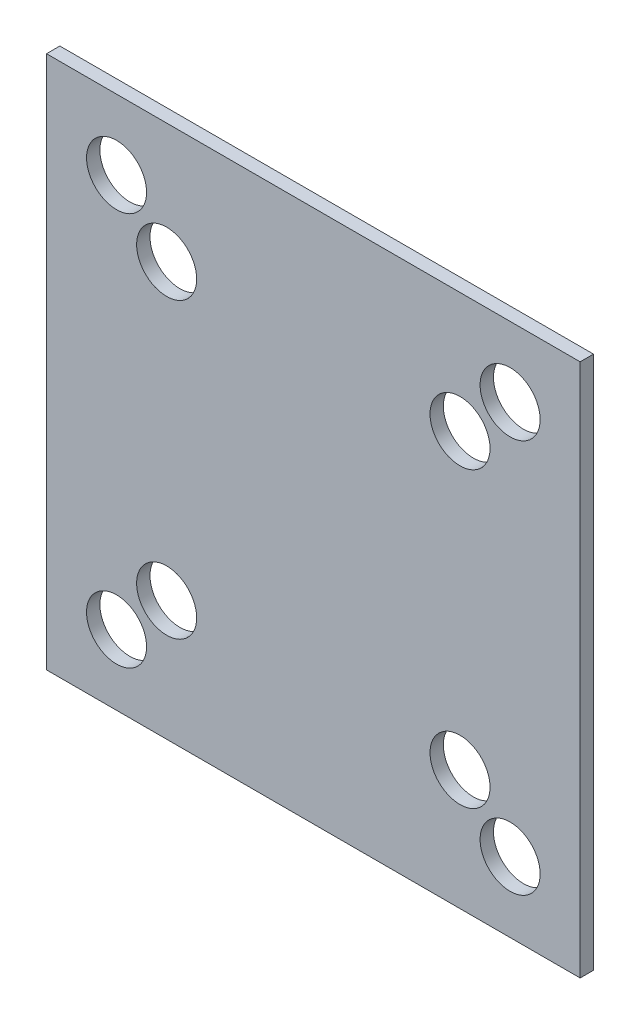
ISO-10303-21;
HEADER;
FILE_DESCRIPTION(('STEP AP214'),'2;1');
FILE_NAME('part.step','',(''),(''),'','','');
FILE_SCHEMA(('AUTOMOTIVE_DESIGN { 1 0 10303 214 1 1 1 1 }'));
ENDSEC;
DATA;
#1=APPLICATION_CONTEXT('core data for automotive mechanical design processes');
#2=APPLICATION_PROTOCOL_DEFINITION('international standard','automotive_design',2000,#1);
#3=PRODUCT_CONTEXT('',#1,'mechanical');
#4=PRODUCT('Part','Part','',(#3));
#5=PRODUCT_RELATED_PRODUCT_CATEGORY('part','',(#4));
#6=PRODUCT_DEFINITION_FORMATION('','',#4);
#7=PRODUCT_DEFINITION_CONTEXT('part definition',#1,'design');
#8=PRODUCT_DEFINITION('design','',#6,#7);
#9=PRODUCT_DEFINITION_SHAPE('','',#8);
#10=(LENGTH_UNIT() NAMED_UNIT(*) SI_UNIT(.MILLI.,.METRE.));
#11=(NAMED_UNIT(*) PLANE_ANGLE_UNIT() SI_UNIT($,.RADIAN.));
#12=(NAMED_UNIT(*) SI_UNIT($,.STERADIAN.) SOLID_ANGLE_UNIT());
#13=UNCERTAINTY_MEASURE_WITH_UNIT(LENGTH_MEASURE(1.E-05),#10,'distance_accuracy_value','');
#14=(GEOMETRIC_REPRESENTATION_CONTEXT(3) GLOBAL_UNCERTAINTY_ASSIGNED_CONTEXT((#13)) GLOBAL_UNIT_ASSIGNED_CONTEXT((#10,
#11,#12)) REPRESENTATION_CONTEXT('',''));
#15=CARTESIAN_POINT('',(0.,0.,0.));
#16=DIRECTION('',(0.,0.,1.));
#17=DIRECTION('',(1.,0.,0.));
#18=AXIS2_PLACEMENT_3D('',#15,#16,#17);
#19=CARTESIAN_POINT('',(40.,40.,2.));
#20=DIRECTION('',(-1.,0.,0.));
#21=DIRECTION('',(0.,-1.,0.));
#22=AXIS2_PLACEMENT_3D('',#19,#20,#21);
#23=PLANE('',#22);
#24=DIRECTION('',(0.,1.,0.));
#25=VECTOR('',#24,1.);
#26=CARTESIAN_POINT('',(40.,40.,0.));
#27=LINE('',#26,#25);
#28=CARTESIAN_POINT('',(40.,-40.,0.));
#29=VERTEX_POINT('',#28);
#30=CARTESIAN_POINT('',(40.,40.,0.));
#31=VERTEX_POINT('',#30);
#32=EDGE_CURVE('E123',#29,#31,#27,.T.);
#33=ORIENTED_EDGE('',*,*,#32,.T.);
#34=DIRECTION('',(0.,0.,-1.));
#35=VECTOR('',#34,1.);
#36=CARTESIAN_POINT('',(40.,40.,2.));
#37=LINE('',#36,#35);
#38=CARTESIAN_POINT('',(40.,40.,2.));
#39=VERTEX_POINT('',#38);
#40=EDGE_CURVE('E12',#39,#31,#37,.T.);
#41=ORIENTED_EDGE('',*,*,#40,.F.);
#42=DIRECTION('',(0.,1.,0.));
#43=VECTOR('',#42,1.);
#44=CARTESIAN_POINT('',(40.,40.,2.));
#45=LINE('',#44,#43);
#46=CARTESIAN_POINT('',(40.,-40.,2.));
#47=VERTEX_POINT('',#46);
#48=EDGE_CURVE('E110',#47,#39,#45,.T.);
#49=ORIENTED_EDGE('',*,*,#48,.F.);
#50=DIRECTION('',(0.,0.,-1.));
#51=VECTOR('',#50,1.);
#52=CARTESIAN_POINT('',(40.,-40.,2.));
#53=LINE('',#52,#51);
#54=EDGE_CURVE('E119',#47,#29,#53,.T.);
#55=ORIENTED_EDGE('',*,*,#54,.T.);
#56=EDGE_LOOP('',(#33,#41,#49,#55));
#57=FACE_BOUND('',#56,.T.);
#58=ADVANCED_FACE('F57',(#57),#23,.F.);
#59=CARTESIAN_POINT('',(-40.,40.,2.));
#60=DIRECTION('',(0.,-1.,0.));
#61=DIRECTION('',(0.,0.,-1.));
#62=AXIS2_PLACEMENT_3D('',#59,#60,#61);
#63=PLANE('',#62);
#64=DIRECTION('',(-1.,0.,0.));
#65=VECTOR('',#64,1.);
#66=CARTESIAN_POINT('',(-40.,40.,0.));
#67=LINE('',#66,#65);
#68=CARTESIAN_POINT('',(-40.,40.,0.));
#69=VERTEX_POINT('',#68);
#70=EDGE_CURVE('E114',#31,#69,#67,.T.);
#71=ORIENTED_EDGE('',*,*,#70,.T.);
#72=DIRECTION('',(0.,0.,-1.));
#73=VECTOR('',#72,1.);
#74=CARTESIAN_POINT('',(-40.,40.,2.));
#75=LINE('',#74,#73);
#76=CARTESIAN_POINT('',(-40.,40.,2.));
#77=VERTEX_POINT('',#76);
#78=EDGE_CURVE('E66',#77,#69,#75,.T.);
#79=ORIENTED_EDGE('',*,*,#78,.F.);
#80=DIRECTION('',(-1.,0.,0.));
#81=VECTOR('',#80,1.);
#82=CARTESIAN_POINT('',(-40.,40.,2.));
#83=LINE('',#82,#81);
#84=EDGE_CURVE('E105',#39,#77,#83,.T.);
#85=ORIENTED_EDGE('',*,*,#84,.F.);
#86=ORIENTED_EDGE('',*,*,#40,.T.);
#87=EDGE_LOOP('',(#71,#79,#85,#86));
#88=FACE_BOUND('',#87,.T.);
#89=ADVANCED_FACE('F113',(#88),#63,.F.);
#90=CARTESIAN_POINT('',(-40.,40.,2.));
#91=DIRECTION('',(1.,0.,0.));
#92=DIRECTION('',(0.,1.,0.));
#93=AXIS2_PLACEMENT_3D('',#90,#91,#92);
#94=PLANE('',#93);
#95=DIRECTION('',(0.,-1.,0.));
#96=VECTOR('',#95,1.);
#97=CARTESIAN_POINT('',(-40.,40.,0.));
#98=LINE('',#97,#96);
#99=CARTESIAN_POINT('',(-40.,-40.,0.));
#100=VERTEX_POINT('',#99);
#101=EDGE_CURVE('E92',#69,#100,#98,.T.);
#102=ORIENTED_EDGE('',*,*,#101,.T.);
#103=DIRECTION('',(0.,0.,-1.));
#104=VECTOR('',#103,1.);
#105=CARTESIAN_POINT('',(-40.,-40.,2.));
#106=LINE('',#105,#104);
#107=CARTESIAN_POINT('',(-40.,-40.,2.));
#108=VERTEX_POINT('',#107);
#109=EDGE_CURVE('E115',#108,#100,#106,.T.);
#110=ORIENTED_EDGE('',*,*,#109,.F.);
#111=DIRECTION('',(0.,-1.,0.));
#112=VECTOR('',#111,1.);
#113=CARTESIAN_POINT('',(-40.,40.,2.));
#114=LINE('',#113,#112);
#115=EDGE_CURVE('E108',#77,#108,#114,.T.);
#116=ORIENTED_EDGE('',*,*,#115,.F.);
#117=ORIENTED_EDGE('',*,*,#78,.T.);
#118=EDGE_LOOP('',(#102,#110,#116,#117));
#119=FACE_BOUND('',#118,.T.);
#120=ADVANCED_FACE('F117',(#119),#94,.F.);
#121=CARTESIAN_POINT('',(-40.,-40.,2.));
#122=DIRECTION('',(0.,1.,0.));
#123=DIRECTION('',(0.,0.,1.));
#124=AXIS2_PLACEMENT_3D('',#121,#122,#123);
#125=PLANE('',#124);
#126=DIRECTION('',(1.,0.,0.));
#127=VECTOR('',#126,1.);
#128=CARTESIAN_POINT('',(-40.,-40.,0.));
#129=LINE('',#128,#127);
#130=EDGE_CURVE('E98',#100,#29,#129,.T.);
#131=ORIENTED_EDGE('',*,*,#130,.T.);
#132=ORIENTED_EDGE('',*,*,#54,.F.);
#133=DIRECTION('',(1.,0.,0.));
#134=VECTOR('',#133,1.);
#135=CARTESIAN_POINT('',(-40.,-40.,2.));
#136=LINE('',#135,#134);
#137=EDGE_CURVE('E75',#108,#47,#136,.T.);
#138=ORIENTED_EDGE('',*,*,#137,.F.);
#139=ORIENTED_EDGE('',*,*,#109,.T.);
#140=EDGE_LOOP('',(#131,#132,#138,#139));
#141=FACE_BOUND('',#140,.T.);
#142=ADVANCED_FACE('F188',(#141),#125,.F.);
#143=CARTESIAN_POINT('',(0.,0.,2.));
#144=DIRECTION('',(0.,0.,1.));
#145=DIRECTION('',(1.,0.,0.));
#146=AXIS2_PLACEMENT_3D('',#143,#144,#145);
#147=PLANE('',#146);
#148=CARTESIAN_POINT('',(-21.99,-21.99,2.));
#149=DIRECTION('',(0.,0.,1.));
#150=DIRECTION('',(1.,0.,0.));
#151=AXIS2_PLACEMENT_3D('',#148,#149,#150);
#152=CIRCLE('',#151,4.5);
#153=CARTESIAN_POINT('',(-17.49,-21.99,2.));
#154=VERTEX_POINT('',#153);
#155=EDGE_CURVE('E306',#154,#154,#152,.T.);
#156=ORIENTED_EDGE('',*,*,#155,.F.);
#157=EDGE_LOOP('',(#156));
#158=FACE_BOUND('',#157,.T.);
#159=CARTESIAN_POINT('',(21.99,21.99,2.));
#160=DIRECTION('',(0.,0.,1.));
#161=DIRECTION('',(1.,0.,0.));
#162=AXIS2_PLACEMENT_3D('',#159,#160,#161);
#163=CIRCLE('',#162,4.5);
#164=CARTESIAN_POINT('',(26.49,21.99,2.));
#165=VERTEX_POINT('',#164);
#166=EDGE_CURVE('E301',#165,#165,#163,.T.);
#167=ORIENTED_EDGE('',*,*,#166,.F.);
#168=EDGE_LOOP('',(#167));
#169=FACE_BOUND('',#168,.T.);
#170=CARTESIAN_POINT('',(29.5,29.5,2.));
#171=DIRECTION('',(0.,0.,1.));
#172=DIRECTION('',(1.,0.,0.));
#173=AXIS2_PLACEMENT_3D('',#170,#171,#172);
#174=CIRCLE('',#173,4.5);
#175=CARTESIAN_POINT('',(34.,29.5,2.));
#176=VERTEX_POINT('',#175);
#177=EDGE_CURVE('E281',#176,#176,#174,.T.);
#178=ORIENTED_EDGE('',*,*,#177,.F.);
#179=EDGE_LOOP('',(#178));
#180=FACE_BOUND('',#179,.T.);
#181=CARTESIAN_POINT('',(21.99,-21.99,2.));
#182=DIRECTION('',(0.,0.,1.));
#183=DIRECTION('',(1.,0.,0.));
#184=AXIS2_PLACEMENT_3D('',#181,#182,#183);
#185=CIRCLE('',#184,4.5);
#186=CARTESIAN_POINT('',(26.49,-21.99,2.));
#187=VERTEX_POINT('',#186);
#188=EDGE_CURVE('E300',#187,#187,#185,.T.);
#189=ORIENTED_EDGE('',*,*,#188,.F.);
#190=EDGE_LOOP('',(#189));
#191=FACE_BOUND('',#190,.T.);
#192=CARTESIAN_POINT('',(-29.5,29.5,2.));
#193=DIRECTION('',(0.,0.,1.));
#194=DIRECTION('',(1.,0.,0.));
#195=AXIS2_PLACEMENT_3D('',#192,#193,#194);
#196=CIRCLE('',#195,4.5);
#197=CARTESIAN_POINT('',(-25.,29.5,2.));
#198=VERTEX_POINT('',#197);
#199=EDGE_CURVE('E318',#198,#198,#196,.T.);
#200=ORIENTED_EDGE('',*,*,#199,.F.);
#201=EDGE_LOOP('',(#200));
#202=FACE_BOUND('',#201,.T.);
#203=CARTESIAN_POINT('',(-21.99,21.99,2.));
#204=DIRECTION('',(0.,0.,1.));
#205=DIRECTION('',(1.,0.,0.));
#206=AXIS2_PLACEMENT_3D('',#203,#204,#205);
#207=CIRCLE('',#206,4.5);
#208=CARTESIAN_POINT('',(-17.49,21.99,2.));
#209=VERTEX_POINT('',#208);
#210=EDGE_CURVE('E315',#209,#209,#207,.T.);
#211=ORIENTED_EDGE('',*,*,#210,.F.);
#212=EDGE_LOOP('',(#211));
#213=FACE_BOUND('',#212,.T.);
#214=CARTESIAN_POINT('',(-29.5,-29.5,2.));
#215=DIRECTION('',(0.,0.,1.));
#216=DIRECTION('',(1.,0.,0.));
#217=AXIS2_PLACEMENT_3D('',#214,#215,#216);
#218=CIRCLE('',#217,4.5);
#219=CARTESIAN_POINT('',(-25.,-29.5,2.));
#220=VERTEX_POINT('',#219);
#221=EDGE_CURVE('E313',#220,#220,#218,.T.);
#222=ORIENTED_EDGE('',*,*,#221,.F.);
#223=EDGE_LOOP('',(#222));
#224=FACE_BOUND('',#223,.T.);
#225=CARTESIAN_POINT('',(29.5,-29.5,2.));
#226=DIRECTION('',(0.,0.,1.));
#227=DIRECTION('',(1.,0.,0.));
#228=AXIS2_PLACEMENT_3D('',#225,#226,#227);
#229=CIRCLE('',#228,4.5);
#230=CARTESIAN_POINT('',(34.,-29.5,2.));
#231=VERTEX_POINT('',#230);
#232=EDGE_CURVE('E135',#231,#231,#229,.T.);
#233=ORIENTED_EDGE('',*,*,#232,.F.);
#234=EDGE_LOOP('',(#233));
#235=FACE_BOUND('',#234,.T.);
#236=ORIENTED_EDGE('',*,*,#48,.T.);
#237=ORIENTED_EDGE('',*,*,#84,.T.);
#238=ORIENTED_EDGE('',*,*,#115,.T.);
#239=ORIENTED_EDGE('',*,*,#137,.T.);
#240=EDGE_LOOP('',(#236,#237,#238,#239));
#241=FACE_BOUND('',#240,.T.);
#242=ADVANCED_FACE('F106',(#158,#169,#180,#191,#202,#213,#224,#235,#241),#147,.T.);
#243=CARTESIAN_POINT('',(0.,0.,0.));
#244=DIRECTION('',(0.,0.,1.));
#245=DIRECTION('',(1.,0.,0.));
#246=AXIS2_PLACEMENT_3D('',#243,#244,#245);
#247=PLANE('',#246);
#248=CARTESIAN_POINT('',(-21.99,-21.99,0.));
#249=DIRECTION('',(0.,0.,1.));
#250=DIRECTION('',(1.,0.,0.));
#251=AXIS2_PLACEMENT_3D('',#248,#249,#250);
#252=CIRCLE('',#251,4.5);
#253=CARTESIAN_POINT('',(-17.49,-21.99,0.));
#254=VERTEX_POINT('',#253);
#255=EDGE_CURVE('E60',#254,#254,#252,.T.);
#256=ORIENTED_EDGE('',*,*,#255,.T.);
#257=EDGE_LOOP('',(#256));
#258=FACE_BOUND('',#257,.T.);
#259=CARTESIAN_POINT('',(21.99,21.99,0.));
#260=DIRECTION('',(0.,0.,1.));
#261=DIRECTION('',(1.,0.,0.));
#262=AXIS2_PLACEMENT_3D('',#259,#260,#261);
#263=CIRCLE('',#262,4.5);
#264=CARTESIAN_POINT('',(26.49,21.99,0.));
#265=VERTEX_POINT('',#264);
#266=EDGE_CURVE('E149',#265,#265,#263,.T.);
#267=ORIENTED_EDGE('',*,*,#266,.T.);
#268=EDGE_LOOP('',(#267));
#269=FACE_BOUND('',#268,.T.);
#270=CARTESIAN_POINT('',(29.5,29.5,0.));
#271=DIRECTION('',(0.,0.,1.));
#272=DIRECTION('',(1.,0.,0.));
#273=AXIS2_PLACEMENT_3D('',#270,#271,#272);
#274=CIRCLE('',#273,4.5);
#275=CARTESIAN_POINT('',(34.,29.5,0.));
#276=VERTEX_POINT('',#275);
#277=EDGE_CURVE('E147',#276,#276,#274,.T.);
#278=ORIENTED_EDGE('',*,*,#277,.T.);
#279=EDGE_LOOP('',(#278));
#280=FACE_BOUND('',#279,.T.);
#281=CARTESIAN_POINT('',(21.99,-21.99,0.));
#282=DIRECTION('',(0.,0.,1.));
#283=DIRECTION('',(1.,0.,0.));
#284=AXIS2_PLACEMENT_3D('',#281,#282,#283);
#285=CIRCLE('',#284,4.5);
#286=CARTESIAN_POINT('',(26.49,-21.99,0.));
#287=VERTEX_POINT('',#286);
#288=EDGE_CURVE('E144',#287,#287,#285,.T.);
#289=ORIENTED_EDGE('',*,*,#288,.T.);
#290=EDGE_LOOP('',(#289));
#291=FACE_BOUND('',#290,.T.);
#292=CARTESIAN_POINT('',(-29.5,29.5,0.));
#293=DIRECTION('',(0.,0.,1.));
#294=DIRECTION('',(1.,0.,0.));
#295=AXIS2_PLACEMENT_3D('',#292,#293,#294);
#296=CIRCLE('',#295,4.5);
#297=CARTESIAN_POINT('',(-25.,29.5,0.));
#298=VERTEX_POINT('',#297);
#299=EDGE_CURVE('E141',#298,#298,#296,.T.);
#300=ORIENTED_EDGE('',*,*,#299,.T.);
#301=EDGE_LOOP('',(#300));
#302=FACE_BOUND('',#301,.T.);
#303=CARTESIAN_POINT('',(-21.99,21.99,0.));
#304=DIRECTION('',(0.,0.,1.));
#305=DIRECTION('',(1.,0.,0.));
#306=AXIS2_PLACEMENT_3D('',#303,#304,#305);
#307=CIRCLE('',#306,4.5);
#308=CARTESIAN_POINT('',(-17.49,21.99,0.));
#309=VERTEX_POINT('',#308);
#310=EDGE_CURVE('E138',#309,#309,#307,.T.);
#311=ORIENTED_EDGE('',*,*,#310,.T.);
#312=EDGE_LOOP('',(#311));
#313=FACE_BOUND('',#312,.T.);
#314=CARTESIAN_POINT('',(-29.5,-29.5,0.));
#315=DIRECTION('',(0.,0.,1.));
#316=DIRECTION('',(1.,0.,0.));
#317=AXIS2_PLACEMENT_3D('',#314,#315,#316);
#318=CIRCLE('',#317,4.5);
#319=CARTESIAN_POINT('',(-25.,-29.5,0.));
#320=VERTEX_POINT('',#319);
#321=EDGE_CURVE('E134',#320,#320,#318,.T.);
#322=ORIENTED_EDGE('',*,*,#321,.T.);
#323=EDGE_LOOP('',(#322));
#324=FACE_BOUND('',#323,.T.);
#325=CARTESIAN_POINT('',(29.5,-29.5,0.));
#326=DIRECTION('',(0.,0.,1.));
#327=DIRECTION('',(1.,0.,0.));
#328=AXIS2_PLACEMENT_3D('',#325,#326,#327);
#329=CIRCLE('',#328,4.5);
#330=CARTESIAN_POINT('',(34.,-29.5,0.));
#331=VERTEX_POINT('',#330);
#332=EDGE_CURVE('E131',#331,#331,#329,.T.);
#333=ORIENTED_EDGE('',*,*,#332,.T.);
#334=EDGE_LOOP('',(#333));
#335=FACE_BOUND('',#334,.T.);
#336=ORIENTED_EDGE('',*,*,#32,.F.);
#337=ORIENTED_EDGE('',*,*,#130,.F.);
#338=ORIENTED_EDGE('',*,*,#101,.F.);
#339=ORIENTED_EDGE('',*,*,#70,.F.);
#340=EDGE_LOOP('',(#336,#337,#338,#339));
#341=FACE_BOUND('',#340,.T.);
#342=ADVANCED_FACE('F156',(#258,#269,#280,#291,#302,#313,#324,#335,#341),#247,.F.);
#343=CARTESIAN_POINT('',(29.5,-29.5,-8.));
#344=DIRECTION('',(0.,0.,1.));
#345=DIRECTION('',(1.,0.,0.));
#346=AXIS2_PLACEMENT_3D('',#343,#344,#345);
#347=CYLINDRICAL_SURFACE('',#346,4.5);
#348=ORIENTED_EDGE('',*,*,#232,.T.);
#349=EDGE_LOOP('',(#348));
#350=FACE_BOUND('',#349,.T.);
#351=ORIENTED_EDGE('',*,*,#332,.F.);
#352=EDGE_LOOP('',(#351));
#353=FACE_BOUND('',#352,.T.);
#354=ADVANCED_FACE('F179',(#350,#353),#347,.F.);
#355=CARTESIAN_POINT('',(-29.5,-29.5,-8.));
#356=DIRECTION('',(0.,0.,1.));
#357=DIRECTION('',(1.,0.,0.));
#358=AXIS2_PLACEMENT_3D('',#355,#356,#357);
#359=CYLINDRICAL_SURFACE('',#358,4.5);
#360=ORIENTED_EDGE('',*,*,#221,.T.);
#361=EDGE_LOOP('',(#360));
#362=FACE_BOUND('',#361,.T.);
#363=ORIENTED_EDGE('',*,*,#321,.F.);
#364=EDGE_LOOP('',(#363));
#365=FACE_BOUND('',#364,.T.);
#366=ADVANCED_FACE('F185',(#362,#365),#359,.F.);
#367=CARTESIAN_POINT('',(-21.99,21.99,-8.));
#368=DIRECTION('',(0.,0.,1.));
#369=DIRECTION('',(1.,0.,0.));
#370=AXIS2_PLACEMENT_3D('',#367,#368,#369);
#371=CYLINDRICAL_SURFACE('',#370,4.5);
#372=ORIENTED_EDGE('',*,*,#210,.T.);
#373=EDGE_LOOP('',(#372));
#374=FACE_BOUND('',#373,.T.);
#375=ORIENTED_EDGE('',*,*,#310,.F.);
#376=EDGE_LOOP('',(#375));
#377=FACE_BOUND('',#376,.T.);
#378=ADVANCED_FACE('F226',(#374,#377),#371,.F.);
#379=CARTESIAN_POINT('',(-29.5,29.5,-8.));
#380=DIRECTION('',(0.,0.,1.));
#381=DIRECTION('',(1.,0.,0.));
#382=AXIS2_PLACEMENT_3D('',#379,#380,#381);
#383=CYLINDRICAL_SURFACE('',#382,4.5);
#384=ORIENTED_EDGE('',*,*,#199,.T.);
#385=EDGE_LOOP('',(#384));
#386=FACE_BOUND('',#385,.T.);
#387=ORIENTED_EDGE('',*,*,#299,.F.);
#388=EDGE_LOOP('',(#387));
#389=FACE_BOUND('',#388,.T.);
#390=ADVANCED_FACE('F236',(#386,#389),#383,.F.);
#391=CARTESIAN_POINT('',(21.99,-21.99,-8.));
#392=DIRECTION('',(0.,0.,1.));
#393=DIRECTION('',(1.,0.,0.));
#394=AXIS2_PLACEMENT_3D('',#391,#392,#393);
#395=CYLINDRICAL_SURFACE('',#394,4.5);
#396=ORIENTED_EDGE('',*,*,#188,.T.);
#397=EDGE_LOOP('',(#396));
#398=FACE_BOUND('',#397,.T.);
#399=ORIENTED_EDGE('',*,*,#288,.F.);
#400=EDGE_LOOP('',(#399));
#401=FACE_BOUND('',#400,.T.);
#402=ADVANCED_FACE('F246',(#398,#401),#395,.F.);
#403=CARTESIAN_POINT('',(29.5,29.5,-8.));
#404=DIRECTION('',(0.,0.,1.));
#405=DIRECTION('',(1.,0.,0.));
#406=AXIS2_PLACEMENT_3D('',#403,#404,#405);
#407=CYLINDRICAL_SURFACE('',#406,4.5);
#408=ORIENTED_EDGE('',*,*,#177,.T.);
#409=EDGE_LOOP('',(#408));
#410=FACE_BOUND('',#409,.T.);
#411=ORIENTED_EDGE('',*,*,#277,.F.);
#412=EDGE_LOOP('',(#411));
#413=FACE_BOUND('',#412,.T.);
#414=ADVANCED_FACE('F166',(#410,#413),#407,.F.);
#415=CARTESIAN_POINT('',(21.99,21.99,-8.));
#416=DIRECTION('',(0.,0.,1.));
#417=DIRECTION('',(1.,0.,0.));
#418=AXIS2_PLACEMENT_3D('',#415,#416,#417);
#419=CYLINDRICAL_SURFACE('',#418,4.5);
#420=ORIENTED_EDGE('',*,*,#166,.T.);
#421=EDGE_LOOP('',(#420));
#422=FACE_BOUND('',#421,.T.);
#423=ORIENTED_EDGE('',*,*,#266,.F.);
#424=EDGE_LOOP('',(#423));
#425=FACE_BOUND('',#424,.T.);
#426=ADVANCED_FACE('F160',(#422,#425),#419,.F.);
#427=CARTESIAN_POINT('',(-21.99,-21.99,-8.));
#428=DIRECTION('',(0.,0.,1.));
#429=DIRECTION('',(1.,0.,0.));
#430=AXIS2_PLACEMENT_3D('',#427,#428,#429);
#431=CYLINDRICAL_SURFACE('',#430,4.5);
#432=ORIENTED_EDGE('',*,*,#155,.T.);
#433=EDGE_LOOP('',(#432));
#434=FACE_BOUND('',#433,.T.);
#435=ORIENTED_EDGE('',*,*,#255,.F.);
#436=EDGE_LOOP('',(#435));
#437=FACE_BOUND('',#436,.T.);
#438=ADVANCED_FACE('F158',(#434,#437),#431,.F.);
#439=CLOSED_SHELL('',(#58,#89,#120,#142,#242,#342,#354,#366,#378,#390,#402,#414,#426,#438));
#440=MANIFOLD_SOLID_BREP('B2',#439);
#441=ADVANCED_BREP_SHAPE_REPRESENTATION('',(#18,#440),#14);
#442=SHAPE_DEFINITION_REPRESENTATION(#9,#441);
ENDSEC;
END-ISO-10303-21;
